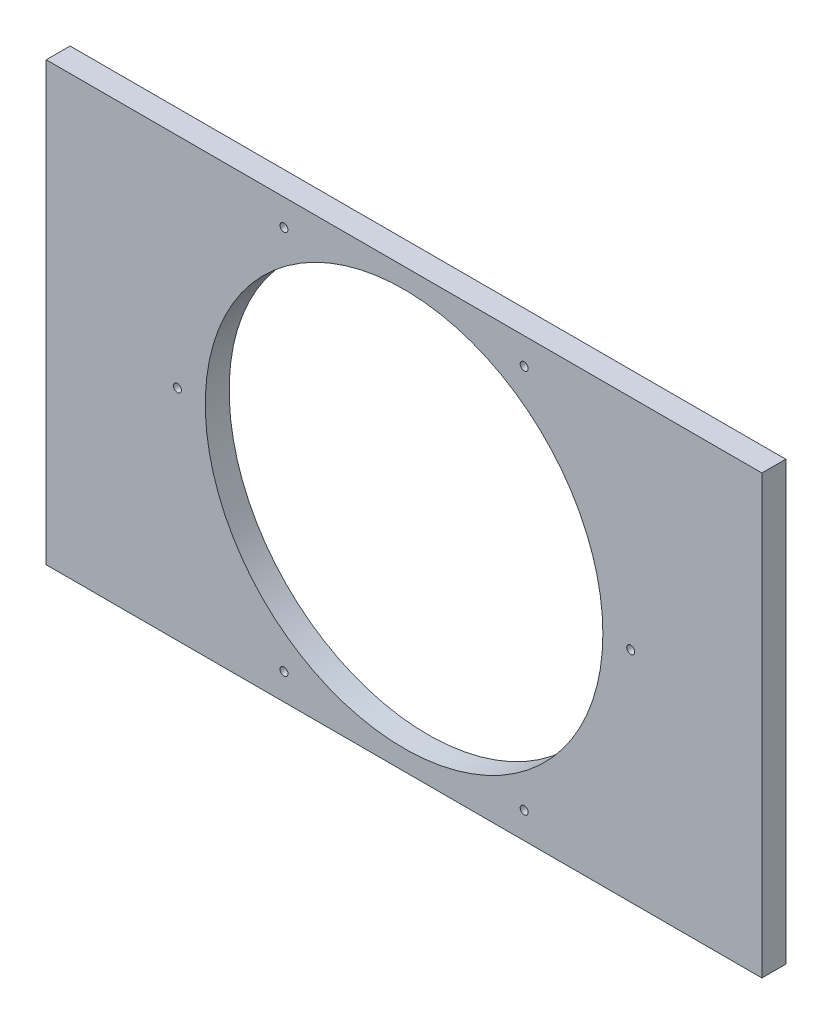
ISO-10303-21;
HEADER;
FILE_DESCRIPTION(('STEP AP214'),'2;1');
FILE_NAME('part.step','',(''),(''),'','','');
FILE_SCHEMA(('AUTOMOTIVE_DESIGN { 1 0 10303 214 1 1 1 1 }'));
ENDSEC;
DATA;
#1=APPLICATION_CONTEXT('core data for automotive mechanical design processes');
#2=APPLICATION_PROTOCOL_DEFINITION('international standard','automotive_design',2000,#1);
#3=PRODUCT_CONTEXT('',#1,'mechanical');
#4=PRODUCT('Part','Part','',(#3));
#5=PRODUCT_RELATED_PRODUCT_CATEGORY('part','',(#4));
#6=PRODUCT_DEFINITION_FORMATION('','',#4);
#7=PRODUCT_DEFINITION_CONTEXT('part definition',#1,'design');
#8=PRODUCT_DEFINITION('design','',#6,#7);
#9=PRODUCT_DEFINITION_SHAPE('','',#8);
#10=(LENGTH_UNIT() NAMED_UNIT(*) SI_UNIT(.MILLI.,.METRE.));
#11=(NAMED_UNIT(*) PLANE_ANGLE_UNIT() SI_UNIT($,.RADIAN.));
#12=(NAMED_UNIT(*) SI_UNIT($,.STERADIAN.) SOLID_ANGLE_UNIT());
#13=UNCERTAINTY_MEASURE_WITH_UNIT(LENGTH_MEASURE(1.E-05),#10,'distance_accuracy_value','');
#14=(GEOMETRIC_REPRESENTATION_CONTEXT(3) GLOBAL_UNCERTAINTY_ASSIGNED_CONTEXT((#13)) GLOBAL_UNIT_ASSIGNED_CONTEXT((#10,
#11,#12)) REPRESENTATION_CONTEXT('',''));
#15=CARTESIAN_POINT('',(0.,0.,0.));
#16=DIRECTION('',(0.,0.,1.));
#17=DIRECTION('',(1.,0.,0.));
#18=AXIS2_PLACEMENT_3D('',#15,#16,#17);
#19=CARTESIAN_POINT('',(0.,0.,6.));
#20=DIRECTION('',(-1.,0.,0.));
#21=DIRECTION('',(0.,0.,1.));
#22=AXIS2_PLACEMENT_3D('',#19,#20,#21);
#23=PLANE('',#22);
#24=DIRECTION('',(0.,1.,0.));
#25=VECTOR('',#24,1.);
#26=CARTESIAN_POINT('',(0.,0.,0.));
#27=LINE('',#26,#25);
#28=CARTESIAN_POINT('',(0.,0.,0.));
#29=VERTEX_POINT('',#28);
#30=CARTESIAN_POINT('',(0.,110.,0.));
#31=VERTEX_POINT('',#30);
#32=EDGE_CURVE('E99',#29,#31,#27,.T.);
#33=ORIENTED_EDGE('',*,*,#32,.F.);
#34=DIRECTION('',(0.,0.,-1.));
#35=VECTOR('',#34,1.);
#36=CARTESIAN_POINT('',(0.,0.,6.));
#37=LINE('',#36,#35);
#38=CARTESIAN_POINT('',(0.,0.,6.));
#39=VERTEX_POINT('',#38);
#40=EDGE_CURVE('E11',#39,#29,#37,.T.);
#41=ORIENTED_EDGE('',*,*,#40,.F.);
#42=DIRECTION('',(0.,1.,0.));
#43=VECTOR('',#42,1.);
#44=CARTESIAN_POINT('',(0.,0.,6.));
#45=LINE('',#44,#43);
#46=CARTESIAN_POINT('',(0.,110.,6.));
#47=VERTEX_POINT('',#46);
#48=EDGE_CURVE('E93',#39,#47,#45,.T.);
#49=ORIENTED_EDGE('',*,*,#48,.T.);
#50=DIRECTION('',(0.,0.,-1.));
#51=VECTOR('',#50,1.);
#52=CARTESIAN_POINT('',(0.,110.,6.));
#53=LINE('',#52,#51);
#54=EDGE_CURVE('E36',#47,#31,#53,.T.);
#55=ORIENTED_EDGE('',*,*,#54,.T.);
#56=EDGE_LOOP('',(#33,#41,#49,#55));
#57=FACE_BOUND('',#56,.T.);
#58=ADVANCED_FACE('F33',(#57),#23,.T.);
#59=CARTESIAN_POINT('',(0.,0.,6.));
#60=DIRECTION('',(0.,1.,0.));
#61=DIRECTION('',(0.,0.,1.));
#62=AXIS2_PLACEMENT_3D('',#59,#60,#61);
#63=PLANE('',#62);
#64=DIRECTION('',(1.,0.,0.));
#65=VECTOR('',#64,1.);
#66=CARTESIAN_POINT('',(0.,0.,0.));
#67=LINE('',#66,#65);
#68=CARTESIAN_POINT('',(180.,0.,0.));
#69=VERTEX_POINT('',#68);
#70=EDGE_CURVE('E66',#29,#69,#67,.T.);
#71=ORIENTED_EDGE('',*,*,#70,.T.);
#72=DIRECTION('',(0.,0.,-1.));
#73=VECTOR('',#72,1.);
#74=CARTESIAN_POINT('',(180.,0.,6.));
#75=LINE('',#74,#73);
#76=CARTESIAN_POINT('',(180.,0.,6.));
#77=VERTEX_POINT('',#76);
#78=EDGE_CURVE('E42',#77,#69,#75,.T.);
#79=ORIENTED_EDGE('',*,*,#78,.F.);
#80=DIRECTION('',(1.,0.,0.));
#81=VECTOR('',#80,1.);
#82=CARTESIAN_POINT('',(0.,0.,6.));
#83=LINE('',#82,#81);
#84=EDGE_CURVE('E83',#39,#77,#83,.T.);
#85=ORIENTED_EDGE('',*,*,#84,.F.);
#86=ORIENTED_EDGE('',*,*,#40,.T.);
#87=EDGE_LOOP('',(#71,#79,#85,#86));
#88=FACE_BOUND('',#87,.T.);
#89=ADVANCED_FACE('F110',(#88),#63,.F.);
#90=CARTESIAN_POINT('',(180.,0.,6.));
#91=DIRECTION('',(-1.,0.,0.));
#92=DIRECTION('',(0.,0.,1.));
#93=AXIS2_PLACEMENT_3D('',#90,#91,#92);
#94=PLANE('',#93);
#95=DIRECTION('',(0.,1.,0.));
#96=VECTOR('',#95,1.);
#97=CARTESIAN_POINT('',(180.,0.,0.));
#98=LINE('',#97,#96);
#99=CARTESIAN_POINT('',(180.,110.,0.));
#100=VERTEX_POINT('',#99);
#101=EDGE_CURVE('E90',#69,#100,#98,.T.);
#102=ORIENTED_EDGE('',*,*,#101,.T.);
#103=DIRECTION('',(0.,0.,-1.));
#104=VECTOR('',#103,1.);
#105=CARTESIAN_POINT('',(180.,110.,6.));
#106=LINE('',#105,#104);
#107=CARTESIAN_POINT('',(180.,110.,6.));
#108=VERTEX_POINT('',#107);
#109=EDGE_CURVE('E87',#108,#100,#106,.T.);
#110=ORIENTED_EDGE('',*,*,#109,.F.);
#111=DIRECTION('',(0.,1.,0.));
#112=VECTOR('',#111,1.);
#113=CARTESIAN_POINT('',(180.,0.,6.));
#114=LINE('',#113,#112);
#115=EDGE_CURVE('E78',#77,#108,#114,.T.);
#116=ORIENTED_EDGE('',*,*,#115,.F.);
#117=ORIENTED_EDGE('',*,*,#78,.T.);
#118=EDGE_LOOP('',(#102,#110,#116,#117));
#119=FACE_BOUND('',#118,.T.);
#120=ADVANCED_FACE('F88',(#119),#94,.F.);
#121=CARTESIAN_POINT('',(0.,110.,6.));
#122=DIRECTION('',(0.,1.,0.));
#123=DIRECTION('',(0.,0.,1.));
#124=AXIS2_PLACEMENT_3D('',#121,#122,#123);
#125=PLANE('',#124);
#126=DIRECTION('',(1.,0.,0.));
#127=VECTOR('',#126,1.);
#128=CARTESIAN_POINT('',(0.,110.,0.));
#129=LINE('',#128,#127);
#130=EDGE_CURVE('E102',#31,#100,#129,.T.);
#131=ORIENTED_EDGE('',*,*,#130,.F.);
#132=ORIENTED_EDGE('',*,*,#54,.F.);
#133=DIRECTION('',(1.,0.,0.));
#134=VECTOR('',#133,1.);
#135=CARTESIAN_POINT('',(0.,110.,6.));
#136=LINE('',#135,#134);
#137=EDGE_CURVE('E82',#47,#108,#136,.T.);
#138=ORIENTED_EDGE('',*,*,#137,.T.);
#139=ORIENTED_EDGE('',*,*,#109,.T.);
#140=EDGE_LOOP('',(#131,#132,#138,#139));
#141=FACE_BOUND('',#140,.T.);
#142=ADVANCED_FACE('F92',(#141),#125,.T.);
#143=CARTESIAN_POINT('',(0.,0.,6.));
#144=DIRECTION('',(0.,0.,-1.));
#145=DIRECTION('',(-1.,0.,0.));
#146=AXIS2_PLACEMENT_3D('',#143,#144,#145);
#147=PLANE('',#146);
#148=CARTESIAN_POINT('',(33.,55.,6.));
#149=DIRECTION('',(0.,0.,-1.));
#150=DIRECTION('',(-1.,0.,0.));
#151=AXIS2_PLACEMENT_3D('',#148,#149,#150);
#152=CIRCLE('',#151,0.999999999999998);
#153=CARTESIAN_POINT('',(32.,55.,6.));
#154=VERTEX_POINT('',#153);
#155=EDGE_CURVE('E168',#154,#154,#152,.F.);
#156=ORIENTED_EDGE('',*,*,#155,.F.);
#157=EDGE_LOOP('',(#156));
#158=FACE_BOUND('',#157,.T.);
#159=CARTESIAN_POINT('',(59.7946019387074,6.66125851908362,6.));
#160=DIRECTION('',(0.,0.,-1.));
#161=DIRECTION('',(-1.,0.,0.));
#162=AXIS2_PLACEMENT_3D('',#159,#160,#161);
#163=CIRCLE('',#162,0.999999999999998);
#164=CARTESIAN_POINT('',(58.7946019387074,6.66125851908362,6.));
#165=VERTEX_POINT('',#164);
#166=EDGE_CURVE('E172',#165,#165,#163,.F.);
#167=ORIENTED_EDGE('',*,*,#166,.F.);
#168=EDGE_LOOP('',(#167));
#169=FACE_BOUND('',#168,.T.);
#170=CARTESIAN_POINT('',(120.205398061292,6.66125851908321,6.));
#171=DIRECTION('',(0.,0.,-1.));
#172=DIRECTION('',(-1.,0.,0.));
#173=AXIS2_PLACEMENT_3D('',#170,#171,#172);
#174=CIRCLE('',#173,0.999999999999998);
#175=CARTESIAN_POINT('',(119.205398061292,6.66125851908321,6.));
#176=VERTEX_POINT('',#175);
#177=EDGE_CURVE('E181',#176,#176,#174,.F.);
#178=ORIENTED_EDGE('',*,*,#177,.F.);
#179=EDGE_LOOP('',(#178));
#180=FACE_BOUND('',#179,.T.);
#181=CARTESIAN_POINT('',(147.,55.,6.));
#182=DIRECTION('',(0.,0.,-1.));
#183=DIRECTION('',(-1.,0.,0.));
#184=AXIS2_PLACEMENT_3D('',#181,#182,#183);
#185=CIRCLE('',#184,0.999999999999998);
#186=CARTESIAN_POINT('',(146.,55.,6.));
#187=VERTEX_POINT('',#186);
#188=EDGE_CURVE('E187',#187,#187,#185,.F.);
#189=ORIENTED_EDGE('',*,*,#188,.F.);
#190=EDGE_LOOP('',(#189));
#191=FACE_BOUND('',#190,.T.);
#192=CARTESIAN_POINT('',(120.205398061293,103.338741480916,6.));
#193=DIRECTION('',(0.,0.,-1.));
#194=DIRECTION('',(-1.,0.,0.));
#195=AXIS2_PLACEMENT_3D('',#192,#193,#194);
#196=CIRCLE('',#195,0.999999999999998);
#197=CARTESIAN_POINT('',(119.205398061293,103.338741480916,6.));
#198=VERTEX_POINT('',#197);
#199=EDGE_CURVE('E193',#198,#198,#196,.F.);
#200=ORIENTED_EDGE('',*,*,#199,.F.);
#201=EDGE_LOOP('',(#200));
#202=FACE_BOUND('',#201,.T.);
#203=CARTESIAN_POINT('',(59.7946019387081,103.338741480917,6.));
#204=DIRECTION('',(0.,0.,-1.));
#205=DIRECTION('',(-1.,0.,0.));
#206=AXIS2_PLACEMENT_3D('',#203,#204,#205);
#207=CIRCLE('',#206,0.999999999999998);
#208=CARTESIAN_POINT('',(58.7946019387081,103.338741480917,6.));
#209=VERTEX_POINT('',#208);
#210=EDGE_CURVE('E199',#209,#209,#207,.F.);
#211=ORIENTED_EDGE('',*,*,#210,.F.);
#212=EDGE_LOOP('',(#211));
#213=FACE_BOUND('',#212,.T.);
#214=CARTESIAN_POINT('',(90.,55.,6.));
#215=DIRECTION('',(0.,0.,1.));
#216=DIRECTION('',(1.,0.,0.));
#217=AXIS2_PLACEMENT_3D('',#214,#215,#216);
#218=CIRCLE('',#217,50.);
#219=CARTESIAN_POINT('',(140.,55.,6.));
#220=VERTEX_POINT('',#219);
#221=EDGE_CURVE('E103',#220,#220,#218,.T.);
#222=ORIENTED_EDGE('',*,*,#221,.F.);
#223=EDGE_LOOP('',(#222));
#224=FACE_BOUND('',#223,.T.);
#225=ORIENTED_EDGE('',*,*,#48,.F.);
#226=ORIENTED_EDGE('',*,*,#84,.T.);
#227=ORIENTED_EDGE('',*,*,#115,.T.);
#228=ORIENTED_EDGE('',*,*,#137,.F.);
#229=EDGE_LOOP('',(#225,#226,#227,#228));
#230=FACE_BOUND('',#229,.T.);
#231=ADVANCED_FACE('F81',(#158,#169,#180,#191,#202,#213,#224,#230),#147,.F.);
#232=CARTESIAN_POINT('',(0.,0.,0.));
#233=DIRECTION('',(0.,0.,-1.));
#234=DIRECTION('',(-1.,0.,0.));
#235=AXIS2_PLACEMENT_3D('',#232,#233,#234);
#236=PLANE('',#235);
#237=CARTESIAN_POINT('',(33.,55.,0.));
#238=DIRECTION('',(0.,0.,1.));
#239=DIRECTION('',(1.,0.,0.));
#240=AXIS2_PLACEMENT_3D('',#237,#238,#239);
#241=CIRCLE('',#240,0.999999999999998);
#242=CARTESIAN_POINT('',(34.,55.,0.));
#243=VERTEX_POINT('',#242);
#244=EDGE_CURVE('E166',#243,#243,#241,.T.);
#245=ORIENTED_EDGE('',*,*,#244,.T.);
#246=EDGE_LOOP('',(#245));
#247=FACE_BOUND('',#246,.T.);
#248=CARTESIAN_POINT('',(59.7946019387074,6.66125851908362,0.));
#249=DIRECTION('',(0.,0.,1.));
#250=DIRECTION('',(1.,0.,0.));
#251=AXIS2_PLACEMENT_3D('',#248,#249,#250);
#252=CIRCLE('',#251,0.999999999999998);
#253=CARTESIAN_POINT('',(60.7946019387074,6.66125851908362,0.));
#254=VERTEX_POINT('',#253);
#255=EDGE_CURVE('E169',#254,#254,#252,.T.);
#256=ORIENTED_EDGE('',*,*,#255,.T.);
#257=EDGE_LOOP('',(#256));
#258=FACE_BOUND('',#257,.T.);
#259=CARTESIAN_POINT('',(120.205398061292,6.66125851908321,0.));
#260=DIRECTION('',(0.,0.,1.));
#261=DIRECTION('',(1.,0.,0.));
#262=AXIS2_PLACEMENT_3D('',#259,#260,#261);
#263=CIRCLE('',#262,0.999999999999998);
#264=CARTESIAN_POINT('',(121.205398061292,6.66125851908321,0.));
#265=VERTEX_POINT('',#264);
#266=EDGE_CURVE('E178',#265,#265,#263,.T.);
#267=ORIENTED_EDGE('',*,*,#266,.T.);
#268=EDGE_LOOP('',(#267));
#269=FACE_BOUND('',#268,.T.);
#270=CARTESIAN_POINT('',(147.,55.,0.));
#271=DIRECTION('',(0.,0.,1.));
#272=DIRECTION('',(1.,0.,0.));
#273=AXIS2_PLACEMENT_3D('',#270,#271,#272);
#274=CIRCLE('',#273,0.999999999999998);
#275=CARTESIAN_POINT('',(148.,55.,0.));
#276=VERTEX_POINT('',#275);
#277=EDGE_CURVE('E184',#276,#276,#274,.T.);
#278=ORIENTED_EDGE('',*,*,#277,.T.);
#279=EDGE_LOOP('',(#278));
#280=FACE_BOUND('',#279,.T.);
#281=CARTESIAN_POINT('',(120.205398061293,103.338741480916,0.));
#282=DIRECTION('',(0.,0.,1.));
#283=DIRECTION('',(1.,0.,0.));
#284=AXIS2_PLACEMENT_3D('',#281,#282,#283);
#285=CIRCLE('',#284,0.999999999999998);
#286=CARTESIAN_POINT('',(121.205398061293,103.338741480916,0.));
#287=VERTEX_POINT('',#286);
#288=EDGE_CURVE('E190',#287,#287,#285,.T.);
#289=ORIENTED_EDGE('',*,*,#288,.T.);
#290=EDGE_LOOP('',(#289));
#291=FACE_BOUND('',#290,.T.);
#292=CARTESIAN_POINT('',(59.7946019387081,103.338741480917,0.));
#293=DIRECTION('',(0.,0.,1.));
#294=DIRECTION('',(1.,0.,0.));
#295=AXIS2_PLACEMENT_3D('',#292,#293,#294);
#296=CIRCLE('',#295,0.999999999999998);
#297=CARTESIAN_POINT('',(60.7946019387081,103.338741480917,0.));
#298=VERTEX_POINT('',#297);
#299=EDGE_CURVE('E196',#298,#298,#296,.T.);
#300=ORIENTED_EDGE('',*,*,#299,.T.);
#301=EDGE_LOOP('',(#300));
#302=FACE_BOUND('',#301,.T.);
#303=CARTESIAN_POINT('',(90.,55.,0.));
#304=DIRECTION('',(0.,0.,1.));
#305=DIRECTION('',(1.,0.,0.));
#306=AXIS2_PLACEMENT_3D('',#303,#304,#305);
#307=CIRCLE('',#306,50.);
#308=CARTESIAN_POINT('',(140.,55.,0.));
#309=VERTEX_POINT('',#308);
#310=EDGE_CURVE('E202',#309,#309,#307,.T.);
#311=ORIENTED_EDGE('',*,*,#310,.T.);
#312=EDGE_LOOP('',(#311));
#313=FACE_BOUND('',#312,.T.);
#314=ORIENTED_EDGE('',*,*,#32,.T.);
#315=ORIENTED_EDGE('',*,*,#130,.T.);
#316=ORIENTED_EDGE('',*,*,#101,.F.);
#317=ORIENTED_EDGE('',*,*,#70,.F.);
#318=EDGE_LOOP('',(#314,#315,#316,#317));
#319=FACE_BOUND('',#318,.T.);
#320=ADVANCED_FACE('F108',(#247,#258,#269,#280,#291,#302,#313,#319),#236,.T.);
#321=CARTESIAN_POINT('',(90.,55.,6.));
#322=DIRECTION('',(0.,0.,-1.));
#323=DIRECTION('',(-1.,0.,0.));
#324=AXIS2_PLACEMENT_3D('',#321,#322,#323);
#325=CYLINDRICAL_SURFACE('',#324,50.);
#326=ORIENTED_EDGE('',*,*,#221,.T.);
#327=EDGE_LOOP('',(#326));
#328=FACE_BOUND('',#327,.T.);
#329=ORIENTED_EDGE('',*,*,#310,.F.);
#330=EDGE_LOOP('',(#329));
#331=FACE_BOUND('',#330,.T.);
#332=ADVANCED_FACE('F130',(#328,#331),#325,.F.);
#333=CARTESIAN_POINT('',(59.7946019387081,103.338741480917,40.));
#334=DIRECTION('',(0.,0.,-1.));
#335=DIRECTION('',(-1.,0.,0.));
#336=AXIS2_PLACEMENT_3D('',#333,#334,#335);
#337=CYLINDRICAL_SURFACE('',#336,0.999999999999998);
#338=ORIENTED_EDGE('',*,*,#299,.F.);
#339=EDGE_LOOP('',(#338));
#340=FACE_BOUND('',#339,.T.);
#341=ORIENTED_EDGE('',*,*,#210,.T.);
#342=EDGE_LOOP('',(#341));
#343=FACE_BOUND('',#342,.T.);
#344=ADVANCED_FACE('F137',(#340,#343),#337,.F.);
#345=CARTESIAN_POINT('',(120.205398061293,103.338741480916,40.));
#346=DIRECTION('',(0.,0.,-1.));
#347=DIRECTION('',(-1.,0.,0.));
#348=AXIS2_PLACEMENT_3D('',#345,#346,#347);
#349=CYLINDRICAL_SURFACE('',#348,0.999999999999998);
#350=ORIENTED_EDGE('',*,*,#288,.F.);
#351=EDGE_LOOP('',(#350));
#352=FACE_BOUND('',#351,.T.);
#353=ORIENTED_EDGE('',*,*,#199,.T.);
#354=EDGE_LOOP('',(#353));
#355=FACE_BOUND('',#354,.T.);
#356=ADVANCED_FACE('F141',(#352,#355),#349,.F.);
#357=CARTESIAN_POINT('',(147.,55.,40.));
#358=DIRECTION('',(0.,0.,-1.));
#359=DIRECTION('',(-1.,0.,0.));
#360=AXIS2_PLACEMENT_3D('',#357,#358,#359);
#361=CYLINDRICAL_SURFACE('',#360,0.999999999999998);
#362=ORIENTED_EDGE('',*,*,#277,.F.);
#363=EDGE_LOOP('',(#362));
#364=FACE_BOUND('',#363,.T.);
#365=ORIENTED_EDGE('',*,*,#188,.T.);
#366=EDGE_LOOP('',(#365));
#367=FACE_BOUND('',#366,.T.);
#368=ADVANCED_FACE('F145',(#364,#367),#361,.F.);
#369=CARTESIAN_POINT('',(120.205398061292,6.66125851908321,40.));
#370=DIRECTION('',(0.,0.,-1.));
#371=DIRECTION('',(-1.,0.,0.));
#372=AXIS2_PLACEMENT_3D('',#369,#370,#371);
#373=CYLINDRICAL_SURFACE('',#372,0.999999999999998);
#374=ORIENTED_EDGE('',*,*,#266,.F.);
#375=EDGE_LOOP('',(#374));
#376=FACE_BOUND('',#375,.T.);
#377=ORIENTED_EDGE('',*,*,#177,.T.);
#378=EDGE_LOOP('',(#377));
#379=FACE_BOUND('',#378,.T.);
#380=ADVANCED_FACE('F149',(#376,#379),#373,.F.);
#381=CARTESIAN_POINT('',(59.7946019387074,6.66125851908362,40.));
#382=DIRECTION('',(0.,0.,-1.));
#383=DIRECTION('',(-1.,0.,0.));
#384=AXIS2_PLACEMENT_3D('',#381,#382,#383);
#385=CYLINDRICAL_SURFACE('',#384,0.999999999999998);
#386=ORIENTED_EDGE('',*,*,#255,.F.);
#387=EDGE_LOOP('',(#386));
#388=FACE_BOUND('',#387,.T.);
#389=ORIENTED_EDGE('',*,*,#166,.T.);
#390=EDGE_LOOP('',(#389));
#391=FACE_BOUND('',#390,.T.);
#392=ADVANCED_FACE('F153',(#388,#391),#385,.F.);
#393=CARTESIAN_POINT('',(33.,55.,40.));
#394=DIRECTION('',(0.,0.,-1.));
#395=DIRECTION('',(-1.,0.,0.));
#396=AXIS2_PLACEMENT_3D('',#393,#394,#395);
#397=CYLINDRICAL_SURFACE('',#396,0.999999999999998);
#398=ORIENTED_EDGE('',*,*,#244,.F.);
#399=EDGE_LOOP('',(#398));
#400=FACE_BOUND('',#399,.T.);
#401=ORIENTED_EDGE('',*,*,#155,.T.);
#402=EDGE_LOOP('',(#401));
#403=FACE_BOUND('',#402,.T.);
#404=ADVANCED_FACE('F157',(#400,#403),#397,.F.);
#405=CLOSED_SHELL('',(#58,#89,#120,#142,#231,#320,#332,#344,#356,#368,#380,#392,#404));
#406=MANIFOLD_SOLID_BREP('B2',#405);
#407=ADVANCED_BREP_SHAPE_REPRESENTATION('',(#18,#406),#14);
#408=SHAPE_DEFINITION_REPRESENTATION(#9,#407);
ENDSEC;
END-ISO-10303-21;
